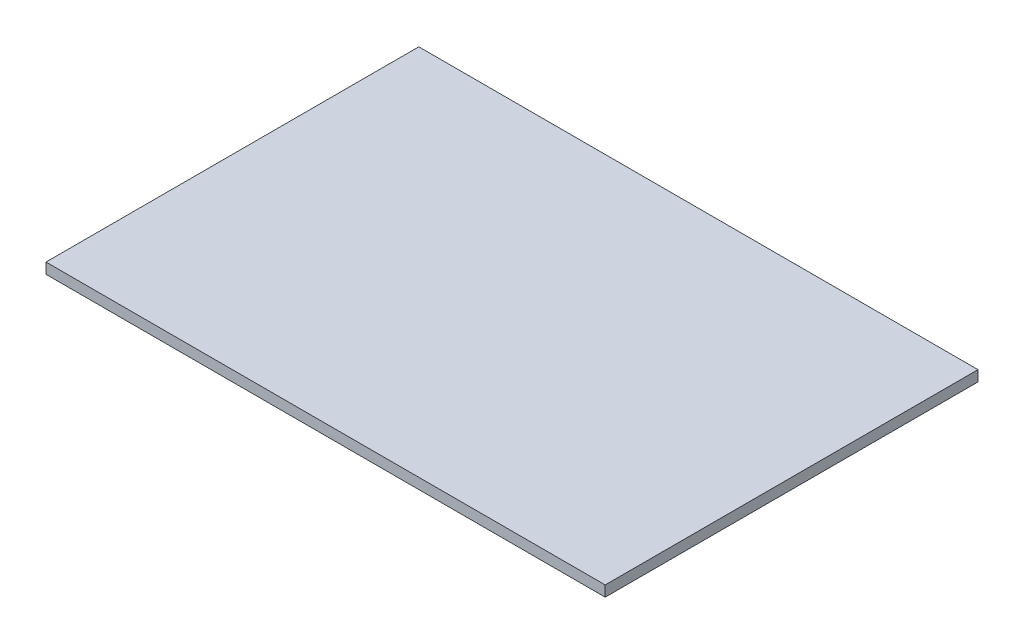
ISO-10303-21;
HEADER;
FILE_DESCRIPTION(('STEP AP214'),'2;1');
FILE_NAME('part.step','',(''),(''),'','','');
FILE_SCHEMA(('AUTOMOTIVE_DESIGN { 1 0 10303 214 1 1 1 1 }'));
ENDSEC;
DATA;
#1=APPLICATION_CONTEXT('core data for automotive mechanical design processes');
#2=APPLICATION_PROTOCOL_DEFINITION('international standard','automotive_design',2000,#1);
#3=PRODUCT_CONTEXT('',#1,'mechanical');
#4=PRODUCT('Part','Part','',(#3));
#5=PRODUCT_RELATED_PRODUCT_CATEGORY('part','',(#4));
#6=PRODUCT_DEFINITION_FORMATION('','',#4);
#7=PRODUCT_DEFINITION_CONTEXT('part definition',#1,'design');
#8=PRODUCT_DEFINITION('design','',#6,#7);
#9=PRODUCT_DEFINITION_SHAPE('','',#8);
#10=(LENGTH_UNIT() NAMED_UNIT(*) SI_UNIT(.MILLI.,.METRE.));
#11=(NAMED_UNIT(*) PLANE_ANGLE_UNIT() SI_UNIT($,.RADIAN.));
#12=(NAMED_UNIT(*) SI_UNIT($,.STERADIAN.) SOLID_ANGLE_UNIT());
#13=UNCERTAINTY_MEASURE_WITH_UNIT(LENGTH_MEASURE(1.E-05),#10,'distance_accuracy_value','');
#14=(GEOMETRIC_REPRESENTATION_CONTEXT(3) GLOBAL_UNCERTAINTY_ASSIGNED_CONTEXT((#13)) GLOBAL_UNIT_ASSIGNED_CONTEXT((#10,
#11,#12)) REPRESENTATION_CONTEXT('',''));
#15=CARTESIAN_POINT('',(0.,0.,0.));
#16=DIRECTION('',(0.,0.,1.));
#17=DIRECTION('',(1.,0.,0.));
#18=AXIS2_PLACEMENT_3D('',#15,#16,#17);
#19=CARTESIAN_POINT('',(52.5,2.,-35.));
#20=DIRECTION('',(-1.,0.,0.));
#21=DIRECTION('',(0.,0.,1.));
#22=AXIS2_PLACEMENT_3D('',#19,#20,#21);
#23=PLANE('',#22);
#24=DIRECTION('',(0.,0.,-1.));
#25=VECTOR('',#24,1.);
#26=CARTESIAN_POINT('',(52.5,0.,-35.));
#27=LINE('',#26,#25);
#28=CARTESIAN_POINT('',(52.5,0.,35.));
#29=VERTEX_POINT('',#28);
#30=CARTESIAN_POINT('',(52.5,0.,-35.));
#31=VERTEX_POINT('',#30);
#32=EDGE_CURVE('E96',#29,#31,#27,.T.);
#33=ORIENTED_EDGE('',*,*,#32,.T.);
#34=DIRECTION('',(0.,-1.,0.));
#35=VECTOR('',#34,1.);
#36=CARTESIAN_POINT('',(52.5,2.,-35.));
#37=LINE('',#36,#35);
#38=CARTESIAN_POINT('',(52.5,2.,-35.));
#39=VERTEX_POINT('',#38);
#40=EDGE_CURVE('E11',#39,#31,#37,.T.);
#41=ORIENTED_EDGE('',*,*,#40,.F.);
#42=DIRECTION('',(0.,0.,-1.));
#43=VECTOR('',#42,1.);
#44=CARTESIAN_POINT('',(52.5,2.,-35.));
#45=LINE('',#44,#43);
#46=CARTESIAN_POINT('',(52.5,2.,35.));
#47=VERTEX_POINT('',#46);
#48=EDGE_CURVE('E84',#47,#39,#45,.T.);
#49=ORIENTED_EDGE('',*,*,#48,.F.);
#50=DIRECTION('',(0.,-1.,0.));
#51=VECTOR('',#50,1.);
#52=CARTESIAN_POINT('',(52.5,2.,35.));
#53=LINE('',#52,#51);
#54=EDGE_CURVE('E92',#47,#29,#53,.T.);
#55=ORIENTED_EDGE('',*,*,#54,.T.);
#56=EDGE_LOOP('',(#33,#41,#49,#55));
#57=FACE_BOUND('',#56,.T.);
#58=ADVANCED_FACE('F33',(#57),#23,.F.);
#59=CARTESIAN_POINT('',(-52.5,2.,-35.));
#60=DIRECTION('',(0.,0.,1.));
#61=DIRECTION('',(1.,0.,0.));
#62=AXIS2_PLACEMENT_3D('',#59,#60,#61);
#63=PLANE('',#62);
#64=DIRECTION('',(-1.,0.,0.));
#65=VECTOR('',#64,1.);
#66=CARTESIAN_POINT('',(-52.5,0.,-35.));
#67=LINE('',#66,#65);
#68=CARTESIAN_POINT('',(-52.5,0.,-35.));
#69=VERTEX_POINT('',#68);
#70=EDGE_CURVE('E88',#31,#69,#67,.T.);
#71=ORIENTED_EDGE('',*,*,#70,.T.);
#72=DIRECTION('',(0.,-1.,0.));
#73=VECTOR('',#72,1.);
#74=CARTESIAN_POINT('',(-52.5,2.,-35.));
#75=LINE('',#74,#73);
#76=CARTESIAN_POINT('',(-52.5,2.,-35.));
#77=VERTEX_POINT('',#76);
#78=EDGE_CURVE('E41',#77,#69,#75,.T.);
#79=ORIENTED_EDGE('',*,*,#78,.F.);
#80=DIRECTION('',(-1.,0.,0.));
#81=VECTOR('',#80,1.);
#82=CARTESIAN_POINT('',(-52.5,2.,-35.));
#83=LINE('',#82,#81);
#84=EDGE_CURVE('E79',#39,#77,#83,.T.);
#85=ORIENTED_EDGE('',*,*,#84,.F.);
#86=ORIENTED_EDGE('',*,*,#40,.T.);
#87=EDGE_LOOP('',(#71,#79,#85,#86));
#88=FACE_BOUND('',#87,.T.);
#89=ADVANCED_FACE('F87',(#88),#63,.F.);
#90=CARTESIAN_POINT('',(-52.5,2.,-35.));
#91=DIRECTION('',(1.,0.,0.));
#92=DIRECTION('',(0.,0.,-1.));
#93=AXIS2_PLACEMENT_3D('',#90,#91,#92);
#94=PLANE('',#93);
#95=DIRECTION('',(0.,0.,1.));
#96=VECTOR('',#95,1.);
#97=CARTESIAN_POINT('',(-52.5,0.,-35.));
#98=LINE('',#97,#96);
#99=CARTESIAN_POINT('',(-52.5,0.,35.));
#100=VERTEX_POINT('',#99);
#101=EDGE_CURVE('E66',#69,#100,#98,.T.);
#102=ORIENTED_EDGE('',*,*,#101,.T.);
#103=DIRECTION('',(0.,-1.,0.));
#104=VECTOR('',#103,1.);
#105=CARTESIAN_POINT('',(-52.5,2.,35.));
#106=LINE('',#105,#104);
#107=CARTESIAN_POINT('',(-52.5,2.,35.));
#108=VERTEX_POINT('',#107);
#109=EDGE_CURVE('E89',#108,#100,#106,.T.);
#110=ORIENTED_EDGE('',*,*,#109,.F.);
#111=DIRECTION('',(0.,0.,1.));
#112=VECTOR('',#111,1.);
#113=CARTESIAN_POINT('',(-52.5,2.,-35.));
#114=LINE('',#113,#112);
#115=EDGE_CURVE('E82',#77,#108,#114,.T.);
#116=ORIENTED_EDGE('',*,*,#115,.F.);
#117=ORIENTED_EDGE('',*,*,#78,.T.);
#118=EDGE_LOOP('',(#102,#110,#116,#117));
#119=FACE_BOUND('',#118,.T.);
#120=ADVANCED_FACE('F90',(#119),#94,.F.);
#121=CARTESIAN_POINT('',(-52.5,2.,35.));
#122=DIRECTION('',(0.,0.,-1.));
#123=DIRECTION('',(-1.,0.,0.));
#124=AXIS2_PLACEMENT_3D('',#121,#122,#123);
#125=PLANE('',#124);
#126=DIRECTION('',(1.,0.,0.));
#127=VECTOR('',#126,1.);
#128=CARTESIAN_POINT('',(-52.5,0.,35.));
#129=LINE('',#128,#127);
#130=EDGE_CURVE('E72',#100,#29,#129,.T.);
#131=ORIENTED_EDGE('',*,*,#130,.T.);
#132=ORIENTED_EDGE('',*,*,#54,.F.);
#133=DIRECTION('',(1.,0.,0.));
#134=VECTOR('',#133,1.);
#135=CARTESIAN_POINT('',(-52.5,2.,35.));
#136=LINE('',#135,#134);
#137=EDGE_CURVE('E49',#108,#47,#136,.T.);
#138=ORIENTED_EDGE('',*,*,#137,.F.);
#139=ORIENTED_EDGE('',*,*,#109,.T.);
#140=EDGE_LOOP('',(#131,#132,#138,#139));
#141=FACE_BOUND('',#140,.T.);
#142=ADVANCED_FACE('F103',(#141),#125,.F.);
#143=CARTESIAN_POINT('',(0.,2.,0.));
#144=DIRECTION('',(0.,1.,0.));
#145=DIRECTION('',(0.,0.,1.));
#146=AXIS2_PLACEMENT_3D('',#143,#144,#145);
#147=PLANE('',#146);
#148=ORIENTED_EDGE('',*,*,#48,.T.);
#149=ORIENTED_EDGE('',*,*,#84,.T.);
#150=ORIENTED_EDGE('',*,*,#115,.T.);
#151=ORIENTED_EDGE('',*,*,#137,.T.);
#152=EDGE_LOOP('',(#148,#149,#150,#151));
#153=FACE_BOUND('',#152,.T.);
#154=ADVANCED_FACE('F80',(#153),#147,.T.);
#155=CARTESIAN_POINT('',(0.,0.,0.));
#156=DIRECTION('',(0.,1.,0.));
#157=DIRECTION('',(0.,0.,1.));
#158=AXIS2_PLACEMENT_3D('',#155,#156,#157);
#159=PLANE('',#158);
#160=ORIENTED_EDGE('',*,*,#32,.F.);
#161=ORIENTED_EDGE('',*,*,#130,.F.);
#162=ORIENTED_EDGE('',*,*,#101,.F.);
#163=ORIENTED_EDGE('',*,*,#70,.F.);
#164=EDGE_LOOP('',(#160,#161,#162,#163));
#165=FACE_BOUND('',#164,.T.);
#166=ADVANCED_FACE('F106',(#165),#159,.F.);
#167=CLOSED_SHELL('',(#58,#89,#120,#142,#154,#166));
#168=MANIFOLD_SOLID_BREP('B2',#167);
#169=ADVANCED_BREP_SHAPE_REPRESENTATION('',(#18,#168),#14);
#170=SHAPE_DEFINITION_REPRESENTATION(#9,#169);
ENDSEC;
END-ISO-10303-21;
